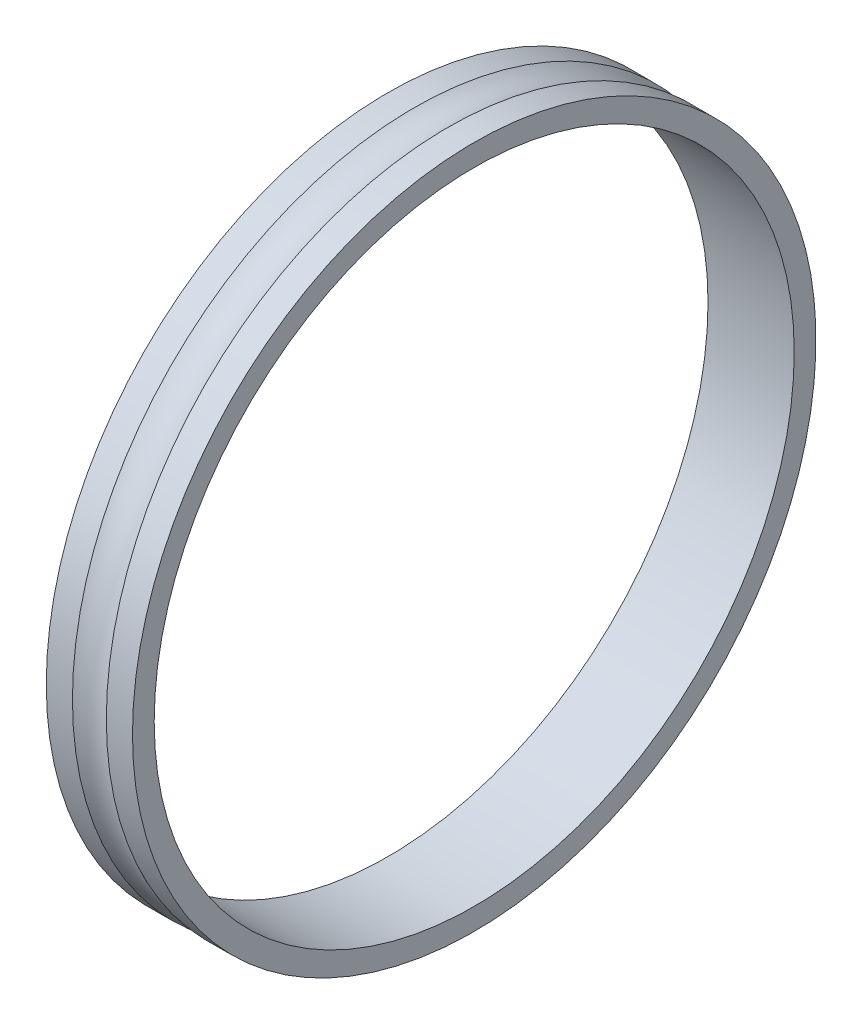
ISO-10303-21;
HEADER;
FILE_DESCRIPTION(('STEP AP214'),'2;1');
FILE_NAME('part.step','',(''),(''),'','','');
FILE_SCHEMA(('AUTOMOTIVE_DESIGN { 1 0 10303 214 1 1 1 1 }'));
ENDSEC;
DATA;
#1=APPLICATION_CONTEXT('core data for automotive mechanical design processes');
#2=APPLICATION_PROTOCOL_DEFINITION('international standard','automotive_design',2000,#1);
#3=PRODUCT_CONTEXT('',#1,'mechanical');
#4=PRODUCT('Part','Part','',(#3));
#5=PRODUCT_RELATED_PRODUCT_CATEGORY('part','',(#4));
#6=PRODUCT_DEFINITION_FORMATION('','',#4);
#7=PRODUCT_DEFINITION_CONTEXT('part definition',#1,'design');
#8=PRODUCT_DEFINITION('design','',#6,#7);
#9=PRODUCT_DEFINITION_SHAPE('','',#8);
#10=(LENGTH_UNIT() NAMED_UNIT(*) SI_UNIT(.MILLI.,.METRE.));
#11=(NAMED_UNIT(*) PLANE_ANGLE_UNIT() SI_UNIT($,.RADIAN.));
#12=(NAMED_UNIT(*) SI_UNIT($,.STERADIAN.) SOLID_ANGLE_UNIT());
#13=UNCERTAINTY_MEASURE_WITH_UNIT(LENGTH_MEASURE(1.E-05),#10,'distance_accuracy_value','');
#14=(GEOMETRIC_REPRESENTATION_CONTEXT(3) GLOBAL_UNCERTAINTY_ASSIGNED_CONTEXT((#13)) GLOBAL_UNIT_ASSIGNED_CONTEXT((#10,
#11,#12)) REPRESENTATION_CONTEXT('',''));
#15=CARTESIAN_POINT('',(0.,0.,0.));
#16=DIRECTION('',(0.,0.,1.));
#17=DIRECTION('',(1.,0.,0.));
#18=AXIS2_PLACEMENT_3D('',#15,#16,#17);
#19=CARTESIAN_POINT('',(64.16,0.,0.));
#20=DIRECTION('',(1.,0.,0.));
#21=DIRECTION('',(0.,0.,-1.));
#22=AXIS2_PLACEMENT_3D('',#19,#20,#21);
#23=TOROIDAL_SURFACE('',#22,69.383,7.15);
#24=CARTESIAN_POINT('',(67.2807388548227,0.,0.));
#25=DIRECTION('',(-1.,0.,0.));
#26=DIRECTION('',(0.,0.,1.));
#27=AXIS2_PLACEMENT_3D('',#24,#25,#26);
#28=CIRCLE('',#27,62.95);
#29=CARTESIAN_POINT('',(67.2807388548227,0.,62.95));
#30=VERTEX_POINT('',#29);
#31=EDGE_CURVE('E31',#30,#30,#28,.F.);
#32=ORIENTED_EDGE('',*,*,#31,.F.);
#33=EDGE_LOOP('',(#32));
#34=FACE_BOUND('',#33,.T.);
#35=CARTESIAN_POINT('',(61.0392611451773,0.,0.));
#36=DIRECTION('',(-1.,0.,0.));
#37=DIRECTION('',(0.,0.,1.));
#38=AXIS2_PLACEMENT_3D('',#35,#36,#37);
#39=CIRCLE('',#38,62.95);
#40=CARTESIAN_POINT('',(61.0392611451773,0.,62.95));
#41=VERTEX_POINT('',#40);
#42=EDGE_CURVE('E36',#41,#41,#39,.T.);
#43=ORIENTED_EDGE('',*,*,#42,.F.);
#44=EDGE_LOOP('',(#43));
#45=FACE_BOUND('',#44,.T.);
#46=ADVANCED_FACE('F15',(#34,#45),#23,.F.);
#47=CARTESIAN_POINT('',(64.16,0.,0.));
#48=DIRECTION('',(-1.,0.,0.));
#49=DIRECTION('',(0.,0.,1.));
#50=AXIS2_PLACEMENT_3D('',#47,#48,#49);
#51=CYLINDRICAL_SURFACE('',#50,62.95);
#52=CARTESIAN_POINT('',(72.1,0.,0.));
#53=DIRECTION('',(-1.,0.,0.));
#54=DIRECTION('',(0.,0.,1.));
#55=AXIS2_PLACEMENT_3D('',#52,#53,#54);
#56=CIRCLE('',#55,62.95);
#57=CARTESIAN_POINT('',(72.1,0.,62.95));
#58=VERTEX_POINT('',#57);
#59=EDGE_CURVE('E19',#58,#58,#56,.F.);
#60=ORIENTED_EDGE('',*,*,#59,.F.);
#61=EDGE_LOOP('',(#60));
#62=FACE_BOUND('',#61,.T.);
#63=ORIENTED_EDGE('',*,*,#31,.T.);
#64=EDGE_LOOP('',(#63));
#65=FACE_BOUND('',#64,.T.);
#66=ADVANCED_FACE('F47',(#62,#65),#51,.T.);
#67=CARTESIAN_POINT('',(64.16,0.,0.));
#68=DIRECTION('',(-1.,0.,0.));
#69=DIRECTION('',(0.,0.,1.));
#70=AXIS2_PLACEMENT_3D('',#67,#68,#69);
#71=CYLINDRICAL_SURFACE('',#70,62.95);
#72=ORIENTED_EDGE('',*,*,#42,.T.);
#73=EDGE_LOOP('',(#72));
#74=FACE_BOUND('',#73,.T.);
#75=CARTESIAN_POINT('',(56.22,0.,0.));
#76=DIRECTION('',(-1.,0.,0.));
#77=DIRECTION('',(0.,0.,1.));
#78=AXIS2_PLACEMENT_3D('',#75,#76,#77);
#79=CIRCLE('',#78,62.95);
#80=CARTESIAN_POINT('',(56.22,0.,62.95));
#81=VERTEX_POINT('',#80);
#82=EDGE_CURVE('E28',#81,#81,#79,.T.);
#83=ORIENTED_EDGE('',*,*,#82,.F.);
#84=EDGE_LOOP('',(#83));
#85=FACE_BOUND('',#84,.T.);
#86=ADVANCED_FACE('F55',(#74,#85),#71,.T.);
#87=CARTESIAN_POINT('',(72.1,0.,60.95));
#88=DIRECTION('',(1.,0.,0.));
#89=DIRECTION('',(0.,0.,-1.));
#90=AXIS2_PLACEMENT_3D('',#87,#88,#89);
#91=PLANE('',#90);
#92=ORIENTED_EDGE('',*,*,#59,.T.);
#93=EDGE_LOOP('',(#92));
#94=FACE_BOUND('',#93,.T.);
#95=CARTESIAN_POINT('',(72.1,0.,0.));
#96=DIRECTION('',(-1.,0.,0.));
#97=DIRECTION('',(0.,0.,1.));
#98=AXIS2_PLACEMENT_3D('',#95,#96,#97);
#99=CIRCLE('',#98,58.95);
#100=CARTESIAN_POINT('',(72.1,0.,58.95));
#101=VERTEX_POINT('',#100);
#102=EDGE_CURVE('E23',#101,#101,#99,.T.);
#103=ORIENTED_EDGE('',*,*,#102,.T.);
#104=EDGE_LOOP('',(#103));
#105=FACE_BOUND('',#104,.T.);
#106=ADVANCED_FACE('F65',(#94,#105),#91,.T.);
#107=CARTESIAN_POINT('',(56.22,0.,60.95));
#108=DIRECTION('',(-1.,0.,0.));
#109=DIRECTION('',(0.,0.,1.));
#110=AXIS2_PLACEMENT_3D('',#107,#108,#109);
#111=PLANE('',#110);
#112=CARTESIAN_POINT('',(56.22,0.,0.));
#113=DIRECTION('',(-1.,0.,0.));
#114=DIRECTION('',(0.,0.,1.));
#115=AXIS2_PLACEMENT_3D('',#112,#113,#114);
#116=CIRCLE('',#115,58.95);
#117=CARTESIAN_POINT('',(56.22,0.,58.95));
#118=VERTEX_POINT('',#117);
#119=EDGE_CURVE('E10',#118,#118,#116,.F.);
#120=ORIENTED_EDGE('',*,*,#119,.T.);
#121=EDGE_LOOP('',(#120));
#122=FACE_BOUND('',#121,.T.);
#123=ORIENTED_EDGE('',*,*,#82,.T.);
#124=EDGE_LOOP('',(#123));
#125=FACE_BOUND('',#124,.T.);
#126=ADVANCED_FACE('F59',(#122,#125),#111,.T.);
#127=CARTESIAN_POINT('',(64.16,0.,0.));
#128=DIRECTION('',(-1.,0.,0.));
#129=DIRECTION('',(0.,0.,1.));
#130=AXIS2_PLACEMENT_3D('',#127,#128,#129);
#131=CYLINDRICAL_SURFACE('',#130,58.95);
#132=ORIENTED_EDGE('',*,*,#119,.F.);
#133=EDGE_LOOP('',(#132));
#134=FACE_BOUND('',#133,.T.);
#135=ORIENTED_EDGE('',*,*,#102,.F.);
#136=EDGE_LOOP('',(#135));
#137=FACE_BOUND('',#136,.T.);
#138=ADVANCED_FACE('F57',(#134,#137),#131,.F.);
#139=CLOSED_SHELL('',(#46,#66,#86,#106,#126,#138));
#140=MANIFOLD_SOLID_BREP('B1',#139);
#141=ADVANCED_BREP_SHAPE_REPRESENTATION('',(#18,#140),#14);
#142=SHAPE_DEFINITION_REPRESENTATION(#9,#141);
ENDSEC;
END-ISO-10303-21;
